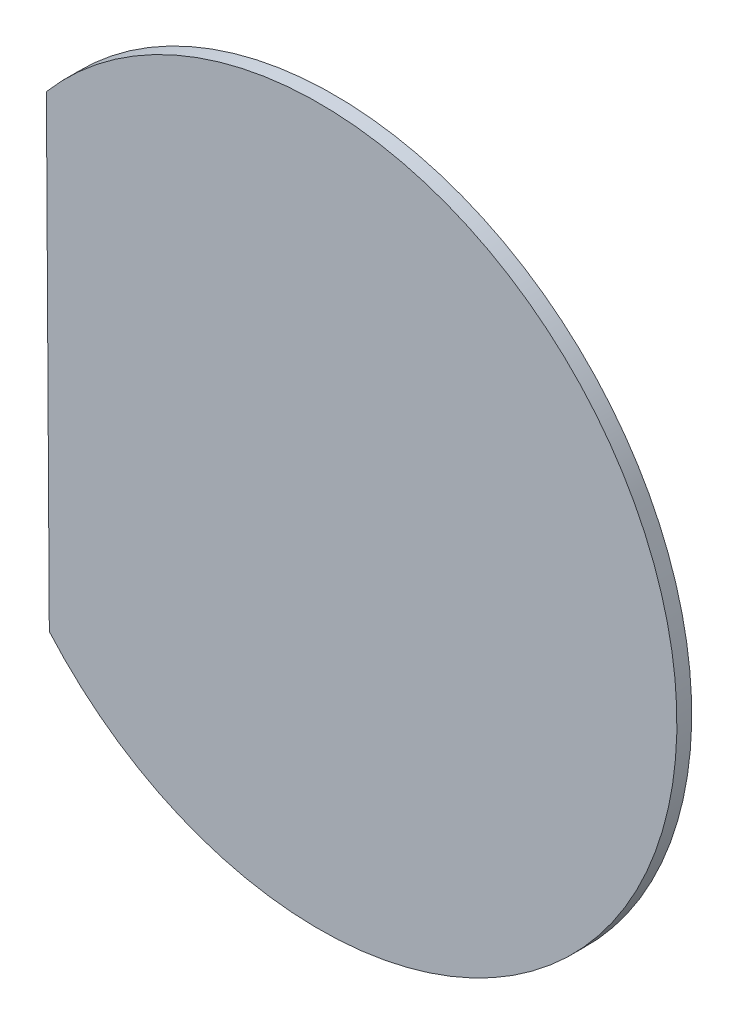
ISO-10303-21;
HEADER;
FILE_DESCRIPTION(('STEP AP214'),'2;1');
FILE_NAME('part.step','',(''),(''),'','','');
FILE_SCHEMA(('AUTOMOTIVE_DESIGN { 1 0 10303 214 1 1 1 1 }'));
ENDSEC;
DATA;
#1=APPLICATION_CONTEXT('core data for automotive mechanical design processes');
#2=APPLICATION_PROTOCOL_DEFINITION('international standard','automotive_design',2000,#1);
#3=PRODUCT_CONTEXT('',#1,'mechanical');
#4=PRODUCT('Part','Part','',(#3));
#5=PRODUCT_RELATED_PRODUCT_CATEGORY('part','',(#4));
#6=PRODUCT_DEFINITION_FORMATION('','',#4);
#7=PRODUCT_DEFINITION_CONTEXT('part definition',#1,'design');
#8=PRODUCT_DEFINITION('design','',#6,#7);
#9=PRODUCT_DEFINITION_SHAPE('','',#8);
#10=(LENGTH_UNIT() NAMED_UNIT(*) SI_UNIT(.MILLI.,.METRE.));
#11=(NAMED_UNIT(*) PLANE_ANGLE_UNIT() SI_UNIT($,.RADIAN.));
#12=(NAMED_UNIT(*) SI_UNIT($,.STERADIAN.) SOLID_ANGLE_UNIT());
#13=UNCERTAINTY_MEASURE_WITH_UNIT(LENGTH_MEASURE(1.E-05),#10,'distance_accuracy_value','');
#14=(GEOMETRIC_REPRESENTATION_CONTEXT(3) GLOBAL_UNCERTAINTY_ASSIGNED_CONTEXT((#13)) GLOBAL_UNIT_ASSIGNED_CONTEXT((#10,
#11,#12)) REPRESENTATION_CONTEXT('',''));
#15=CARTESIAN_POINT('',(0.,0.,0.));
#16=DIRECTION('',(0.,0.,1.));
#17=DIRECTION('',(1.,0.,0.));
#18=AXIS2_PLACEMENT_3D('',#15,#16,#17);
#19=CARTESIAN_POINT('',(-109.997844201603,-0.688673362304732,6.));
#20=DIRECTION('',(0.999980401832751,0.00626066693004302,0.));
#21=DIRECTION('',(-0.00626066693004302,0.999980401832751,0.));
#22=AXIS2_PLACEMENT_3D('',#19,#20,#21);
#23=PLANE('',#22);
#24=DIRECTION('',(0.00626066693004302,-0.999980401832752,0.));
#25=VECTOR('',#24,1.);
#26=CARTESIAN_POINT('',(-109.997844201603,-0.688673362304732,0.));
#27=LINE('',#26,#25);
#28=CARTESIAN_POINT('',(-110.58930329351,93.7816932938198,0.));
#29=VERTEX_POINT('',#28);
#30=CARTESIAN_POINT('',(-109.406385109695,-95.1590400184292,0.));
#31=VERTEX_POINT('',#30);
#32=EDGE_CURVE('E66',#29,#31,#27,.T.);
#33=ORIENTED_EDGE('',*,*,#32,.T.);
#34=DIRECTION('',(0.,0.,-1.));
#35=VECTOR('',#34,1.);
#36=CARTESIAN_POINT('',(-109.406385109695,-95.1590400184292,6.));
#37=LINE('',#36,#35);
#38=CARTESIAN_POINT('',(-109.406385109695,-95.1590400184292,6.));
#39=VERTEX_POINT('',#38);
#40=EDGE_CURVE('E11',#39,#31,#37,.T.);
#41=ORIENTED_EDGE('',*,*,#40,.F.);
#42=DIRECTION('',(0.00626066693004302,-0.999980401832752,0.));
#43=VECTOR('',#42,1.);
#44=CARTESIAN_POINT('',(-109.997844201603,-0.688673362304732,6.));
#45=LINE('',#44,#43);
#46=CARTESIAN_POINT('',(-110.58930329351,93.7816932938198,6.));
#47=VERTEX_POINT('',#46);
#48=EDGE_CURVE('E65',#47,#39,#45,.T.);
#49=ORIENTED_EDGE('',*,*,#48,.F.);
#50=DIRECTION('',(0.,0.,-1.));
#51=VECTOR('',#50,1.);
#52=CARTESIAN_POINT('',(-110.58930329351,93.7816932938198,6.));
#53=LINE('',#52,#51);
#54=EDGE_CURVE('E43',#47,#29,#53,.T.);
#55=ORIENTED_EDGE('',*,*,#54,.T.);
#56=EDGE_LOOP('',(#33,#41,#49,#55));
#57=FACE_BOUND('',#56,.T.);
#58=ADVANCED_FACE('F35',(#57),#23,.F.);
#59=CARTESIAN_POINT('',(0.,0.,6.));
#60=DIRECTION('',(0.,0.,-1.));
#61=DIRECTION('',(-1.,0.,0.));
#62=AXIS2_PLACEMENT_3D('',#59,#60,#61);
#63=CYLINDRICAL_SURFACE('',#62,145.);
#64=CARTESIAN_POINT('',(0.,0.,0.));
#65=DIRECTION('',(0.,0.,1.));
#66=DIRECTION('',(1.,0.,0.));
#67=AXIS2_PLACEMENT_3D('',#64,#65,#66);
#68=CIRCLE('',#67,145.);
#69=EDGE_CURVE('E58',#31,#29,#68,.T.);
#70=ORIENTED_EDGE('',*,*,#69,.T.);
#71=ORIENTED_EDGE('',*,*,#54,.F.);
#72=CARTESIAN_POINT('',(0.,0.,6.));
#73=DIRECTION('',(0.,0.,1.));
#74=DIRECTION('',(1.,0.,0.));
#75=AXIS2_PLACEMENT_3D('',#72,#73,#74);
#76=CIRCLE('',#75,145.);
#77=EDGE_CURVE('E50',#39,#47,#76,.T.);
#78=ORIENTED_EDGE('',*,*,#77,.F.);
#79=ORIENTED_EDGE('',*,*,#40,.T.);
#80=EDGE_LOOP('',(#70,#71,#78,#79));
#81=FACE_BOUND('',#80,.T.);
#82=ADVANCED_FACE('F61',(#81),#63,.T.);
#83=CARTESIAN_POINT('',(0.,0.,6.));
#84=DIRECTION('',(0.,0.,1.));
#85=DIRECTION('',(1.,0.,0.));
#86=AXIS2_PLACEMENT_3D('',#83,#84,#85);
#87=PLANE('',#86);
#88=ORIENTED_EDGE('',*,*,#48,.T.);
#89=ORIENTED_EDGE('',*,*,#77,.T.);
#90=EDGE_LOOP('',(#88,#89));
#91=FACE_BOUND('',#90,.T.);
#92=ADVANCED_FACE('F73',(#91),#87,.T.);
#93=CARTESIAN_POINT('',(0.,0.,0.));
#94=DIRECTION('',(0.,0.,1.));
#95=DIRECTION('',(1.,0.,0.));
#96=AXIS2_PLACEMENT_3D('',#93,#94,#95);
#97=PLANE('',#96);
#98=ORIENTED_EDGE('',*,*,#32,.F.);
#99=ORIENTED_EDGE('',*,*,#69,.F.);
#100=EDGE_LOOP('',(#98,#99));
#101=FACE_BOUND('',#100,.T.);
#102=ADVANCED_FACE('F69',(#101),#97,.F.);
#103=CLOSED_SHELL('',(#58,#82,#92,#102));
#104=MANIFOLD_SOLID_BREP('B2',#103);
#105=ADVANCED_BREP_SHAPE_REPRESENTATION('',(#18,#104),#14);
#106=SHAPE_DEFINITION_REPRESENTATION(#9,#105);
ENDSEC;
END-ISO-10303-21;
